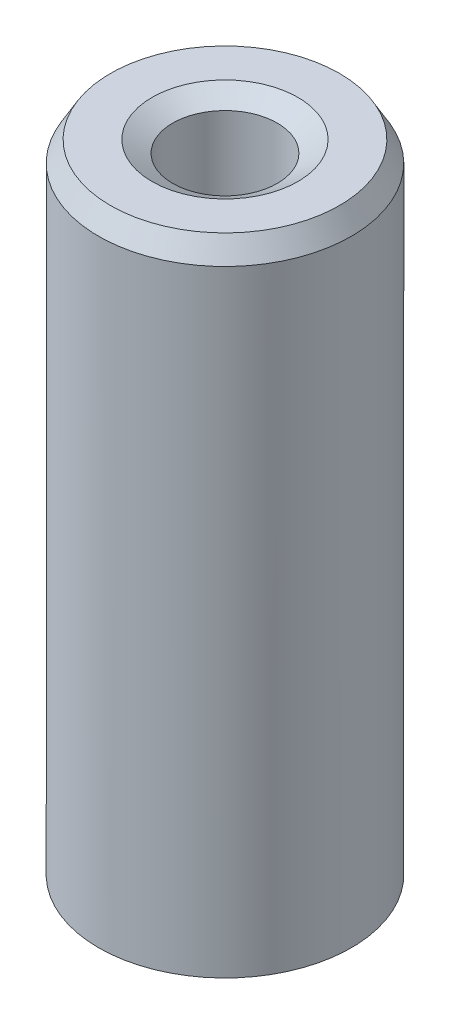
ISO-10303-21;
HEADER;
FILE_DESCRIPTION(('STEP AP214'),'2;1');
FILE_NAME('part.step','',(''),(''),'','','');
FILE_SCHEMA(('AUTOMOTIVE_DESIGN { 1 0 10303 214 1 1 1 1 }'));
ENDSEC;
DATA;
#1=APPLICATION_CONTEXT('core data for automotive mechanical design processes');
#2=APPLICATION_PROTOCOL_DEFINITION('international standard','automotive_design',2000,#1);
#3=PRODUCT_CONTEXT('',#1,'mechanical');
#4=PRODUCT('Part','Part','',(#3));
#5=PRODUCT_RELATED_PRODUCT_CATEGORY('part','',(#4));
#6=PRODUCT_DEFINITION_FORMATION('','',#4);
#7=PRODUCT_DEFINITION_CONTEXT('part definition',#1,'design');
#8=PRODUCT_DEFINITION('design','',#6,#7);
#9=PRODUCT_DEFINITION_SHAPE('','',#8);
#10=(LENGTH_UNIT() NAMED_UNIT(*) SI_UNIT(.MILLI.,.METRE.));
#11=(NAMED_UNIT(*) PLANE_ANGLE_UNIT() SI_UNIT($,.RADIAN.));
#12=(NAMED_UNIT(*) SI_UNIT($,.STERADIAN.) SOLID_ANGLE_UNIT());
#13=UNCERTAINTY_MEASURE_WITH_UNIT(LENGTH_MEASURE(1.E-05),#10,'distance_accuracy_value','');
#14=(GEOMETRIC_REPRESENTATION_CONTEXT(3) GLOBAL_UNCERTAINTY_ASSIGNED_CONTEXT((#13)) GLOBAL_UNIT_ASSIGNED_CONTEXT((#10,
#11,#12)) REPRESENTATION_CONTEXT('',''));
#15=CARTESIAN_POINT('',(0.,0.,0.));
#16=DIRECTION('',(0.,0.,1.));
#17=DIRECTION('',(1.,0.,0.));
#18=AXIS2_PLACEMENT_3D('',#15,#16,#17);
#19=CARTESIAN_POINT('',(0.,102.632128628166,0.));
#20=DIRECTION('',(0.,-1.,0.));
#21=DIRECTION('',(0.,0.,-1.));
#22=AXIS2_PLACEMENT_3D('',#19,#20,#21);
#23=CYLINDRICAL_SURFACE('',#22,20.);
#24=CARTESIAN_POINT('',(0.,1.88614223018305,0.));
#25=DIRECTION('',(0.,1.,0.));
#26=DIRECTION('',(0.,0.,1.));
#27=AXIS2_PLACEMENT_3D('',#24,#25,#26);
#28=CIRCLE('',#27,20.);
#29=CARTESIAN_POINT('',(0.,1.88614223018305,20.));
#30=VERTEX_POINT('',#29);
#31=EDGE_CURVE('E10',#30,#30,#28,.T.);
#32=ORIENTED_EDGE('',*,*,#31,.T.);
#33=EDGE_LOOP('',(#32));
#34=FACE_BOUND('',#33,.T.);
#35=CARTESIAN_POINT('',(0.,99.3652344551875,0.));
#36=DIRECTION('',(0.,1.,0.));
#37=DIRECTION('',(0.,0.,1.));
#38=AXIS2_PLACEMENT_3D('',#35,#36,#37);
#39=CIRCLE('',#38,20.);
#40=CARTESIAN_POINT('',(0.,99.3652344551875,-20.));
#41=VERTEX_POINT('',#40);
#42=EDGE_CURVE('E50',#41,#41,#39,.F.);
#43=ORIENTED_EDGE('',*,*,#42,.T.);
#44=EDGE_LOOP('',(#43));
#45=FACE_BOUND('',#44,.T.);
#46=ADVANCED_FACE('F39',(#34,#45),#23,.T.);
#47=CARTESIAN_POINT('',(0.,102.632128628166,0.));
#48=DIRECTION('',(0.,1.,0.));
#49=DIRECTION('',(0.,0.,1.));
#50=AXIS2_PLACEMENT_3D('',#47,#48,#49);
#51=PLANE('',#50);
#52=CARTESIAN_POINT('',(0.,102.632128628166,0.));
#53=DIRECTION('',(0.,1.,0.));
#54=DIRECTION('',(0.,0.,1.));
#55=AXIS2_PLACEMENT_3D('',#52,#53,#54);
#56=CIRCLE('',#55,11.539607365017);
#57=CARTESIAN_POINT('',(0.,102.632128628166,11.539607365017));
#58=VERTEX_POINT('',#57);
#59=EDGE_CURVE('E58',#58,#58,#56,.F.);
#60=ORIENTED_EDGE('',*,*,#59,.T.);
#61=EDGE_LOOP('',(#60));
#62=FACE_BOUND('',#61,.T.);
#63=CARTESIAN_POINT('',(0.,102.632128628166,0.));
#64=DIRECTION('',(0.,1.,0.));
#65=DIRECTION('',(0.,0.,1.));
#66=AXIS2_PLACEMENT_3D('',#63,#64,#65);
#67=CIRCLE('',#66,18.1138577698169);
#68=CARTESIAN_POINT('',(0.,102.632128628166,-18.1138577698169));
#69=VERTEX_POINT('',#68);
#70=EDGE_CURVE('E61',#69,#69,#67,.T.);
#71=ORIENTED_EDGE('',*,*,#70,.T.);
#72=EDGE_LOOP('',(#71));
#73=FACE_BOUND('',#72,.T.);
#74=ADVANCED_FACE('F88',(#62,#73),#51,.T.);
#75=CARTESIAN_POINT('',(0.,0.,0.));
#76=DIRECTION('',(0.,1.,0.));
#77=DIRECTION('',(0.,0.,1.));
#78=AXIS2_PLACEMENT_3D('',#75,#76,#77);
#79=PLANE('',#78);
#80=CARTESIAN_POINT('',(0.,0.,0.));
#81=DIRECTION('',(0.,1.,0.));
#82=DIRECTION('',(0.,0.,1.));
#83=AXIS2_PLACEMENT_3D('',#80,#81,#82);
#84=CIRCLE('',#83,10.1588554222217);
#85=CARTESIAN_POINT('',(0.,0.,10.1588554222217));
#86=VERTEX_POINT('',#85);
#87=EDGE_CURVE('E51',#86,#86,#84,.T.);
#88=ORIENTED_EDGE('',*,*,#87,.T.);
#89=EDGE_LOOP('',(#88));
#90=FACE_BOUND('',#89,.T.);
#91=CARTESIAN_POINT('',(0.,0.,0.));
#92=DIRECTION('',(0.,1.,0.));
#93=DIRECTION('',(0.,0.,1.));
#94=AXIS2_PLACEMENT_3D('',#91,#92,#93);
#95=CIRCLE('',#94,16.7331058270217);
#96=CARTESIAN_POINT('',(0.,0.,16.7331058270217));
#97=VERTEX_POINT('',#96);
#98=EDGE_CURVE('E54',#97,#97,#95,.F.);
#99=ORIENTED_EDGE('',*,*,#98,.T.);
#100=EDGE_LOOP('',(#99));
#101=FACE_BOUND('',#100,.T.);
#102=ADVANCED_FACE('F83',(#90,#101),#79,.F.);
#103=CARTESIAN_POINT('',(0.,102.632128628166,0.));
#104=DIRECTION('',(0.,-1.,0.));
#105=DIRECTION('',(0.,0.,-1.));
#106=AXIS2_PLACEMENT_3D('',#103,#104,#105);
#107=CYLINDRICAL_SURFACE('',#106,8.27271319203861);
#108=CARTESIAN_POINT('',(0.,100.745986397983,0.));
#109=DIRECTION('',(0.,1.,0.));
#110=DIRECTION('',(0.,0.,1.));
#111=AXIS2_PLACEMENT_3D('',#108,#109,#110);
#112=CIRCLE('',#111,8.27271319203861);
#113=CARTESIAN_POINT('',(0.,100.745986397983,8.27271319203861));
#114=VERTEX_POINT('',#113);
#115=EDGE_CURVE('E67',#114,#114,#112,.T.);
#116=ORIENTED_EDGE('',*,*,#115,.T.);
#117=EDGE_LOOP('',(#116));
#118=FACE_BOUND('',#117,.T.);
#119=CARTESIAN_POINT('',(0.,3.26689417297835,0.));
#120=DIRECTION('',(0.,1.,0.));
#121=DIRECTION('',(0.,0.,1.));
#122=AXIS2_PLACEMENT_3D('',#119,#120,#121);
#123=CIRCLE('',#122,8.27271319203861);
#124=CARTESIAN_POINT('',(0.,3.26689417297835,8.27271319203861));
#125=VERTEX_POINT('',#124);
#126=EDGE_CURVE('E69',#125,#125,#123,.F.);
#127=ORIENTED_EDGE('',*,*,#126,.T.);
#128=EDGE_LOOP('',(#127));
#129=FACE_BOUND('',#128,.T.);
#130=ADVANCED_FACE('F71',(#118,#129),#107,.F.);
#131=CARTESIAN_POINT('',(0.,100.745986397983,0.));
#132=DIRECTION('',(0.,1.,0.));
#133=DIRECTION('',(0.,0.,1.));
#134=AXIS2_PLACEMENT_3D('',#131,#132,#133);
#135=CONICAL_SURFACE('',#134,8.27271319203861,1.0471975511966);
#136=ORIENTED_EDGE('',*,*,#59,.F.);
#137=EDGE_LOOP('',(#136));
#138=FACE_BOUND('',#137,.T.);
#139=ORIENTED_EDGE('',*,*,#115,.F.);
#140=EDGE_LOOP('',(#139));
#141=FACE_BOUND('',#140,.T.);
#142=ADVANCED_FACE('F77',(#138,#141),#135,.F.);
#143=CARTESIAN_POINT('',(0.,0.,0.));
#144=DIRECTION('',(0.,-1.,0.));
#145=DIRECTION('',(0.,0.,-1.));
#146=AXIS2_PLACEMENT_3D('',#143,#144,#145);
#147=CONICAL_SURFACE('',#146,10.1588554222217,0.523598775598296);
#148=ORIENTED_EDGE('',*,*,#126,.F.);
#149=EDGE_LOOP('',(#148));
#150=FACE_BOUND('',#149,.T.);
#151=ORIENTED_EDGE('',*,*,#87,.F.);
#152=EDGE_LOOP('',(#151));
#153=FACE_BOUND('',#152,.T.);
#154=ADVANCED_FACE('F73',(#150,#153),#147,.F.);
#155=CARTESIAN_POINT('',(0.,1.88614223018305,0.));
#156=DIRECTION('',(0.,1.,0.));
#157=DIRECTION('',(0.,0.,1.));
#158=AXIS2_PLACEMENT_3D('',#155,#156,#157);
#159=CONICAL_SURFACE('',#158,20.,1.0471975511966);
#160=ORIENTED_EDGE('',*,*,#98,.F.);
#161=EDGE_LOOP('',(#160));
#162=FACE_BOUND('',#161,.T.);
#163=ORIENTED_EDGE('',*,*,#31,.F.);
#164=EDGE_LOOP('',(#163));
#165=FACE_BOUND('',#164,.T.);
#166=ADVANCED_FACE('F76',(#162,#165),#159,.T.);
#167=CARTESIAN_POINT('',(0.,102.632128628166,0.));
#168=DIRECTION('',(0.,-1.,0.));
#169=DIRECTION('',(0.,0.,-1.));
#170=AXIS2_PLACEMENT_3D('',#167,#168,#169);
#171=CONICAL_SURFACE('',#170,18.1138577698169,0.523598775598296);
#172=CARTESIAN_POINT('',(0.,99.3652344551875,-20.));
#173=CARTESIAN_POINT('',(0.,99.3992646028227,-19.9803526851023));
#174=CARTESIAN_POINT('',(0.,99.4332947504579,-19.9607053702045));
#175=CARTESIAN_POINT('',(0.,99.5013550457282,-19.921410740409));
#176=CARTESIAN_POINT('',(0.,99.5353851933634,-19.9017634255113));
#177=CARTESIAN_POINT('',(0.,99.6034454886338,-19.8624687957158));
#178=CARTESIAN_POINT('',(0.,99.637475636269,-19.8428214808181));
#179=CARTESIAN_POINT('',(0.,99.7055359315394,-19.8035268510226));
#180=CARTESIAN_POINT('',(0.,99.7395660791746,-19.7838795361249));
#181=CARTESIAN_POINT('',(0.,99.807626374445,-19.7445849063294));
#182=CARTESIAN_POINT('',(0.,99.8416565220802,-19.7249375914316));
#183=CARTESIAN_POINT('',(0.,99.9097168173505,-19.6856429616362));
#184=CARTESIAN_POINT('',(0.,99.9437469649857,-19.6659956467384));
#185=CARTESIAN_POINT('',(0.,100.011807260256,-19.6267010169429));
#186=CARTESIAN_POINT('',(0.,100.045837407891,-19.6070537020452));
#187=CARTESIAN_POINT('',(0.,100.113897703162,-19.5677590722497));
#188=CARTESIAN_POINT('',(0.,100.147927850797,-19.548111757352));
#189=CARTESIAN_POINT('',(0.,100.215988146067,-19.5088171275565));
#190=CARTESIAN_POINT('',(0.,100.250018293702,-19.4891698126588));
#191=CARTESIAN_POINT('',(0.,100.318078588973,-19.4498751828633));
#192=CARTESIAN_POINT('',(0.,100.352108736608,-19.4302278679655));
#193=CARTESIAN_POINT('',(0.,100.420169031878,-19.3909332381701));
#194=CARTESIAN_POINT('',(0.,100.454199179514,-19.3712859232723));
#195=CARTESIAN_POINT('',(0.,100.522259474784,-19.3319912934768));
#196=CARTESIAN_POINT('',(0.,100.556289622419,-19.3123439785791));
#197=CARTESIAN_POINT('',(0.,100.62434991769,-19.2730493487836));
#198=CARTESIAN_POINT('',(0.,100.658380065325,-19.2534020338859));
#199=CARTESIAN_POINT('',(0.,100.726440360595,-19.2141074040904));
#200=CARTESIAN_POINT('',(0.,100.76047050823,-19.1944600891927));
#201=CARTESIAN_POINT('',(0.,100.828530803501,-19.1551654593972));
#202=CARTESIAN_POINT('',(0.,100.862560951136,-19.1355181444994));
#203=CARTESIAN_POINT('',(0.,100.930621246406,-19.096223514704));
#204=CARTESIAN_POINT('',(0.,100.964651394041,-19.0765761998062));
#205=CARTESIAN_POINT('',(0.,101.032711689312,-19.0372815700107));
#206=CARTESIAN_POINT('',(0.,101.066741836947,-19.017634255113));
#207=CARTESIAN_POINT('',(0.,101.134802132217,-18.9783396253175));
#208=CARTESIAN_POINT('',(0.,101.168832279853,-18.9586923104198));
#209=CARTESIAN_POINT('',(0.,101.236892575123,-18.9193976806243));
#210=CARTESIAN_POINT('',(0.,101.270922722758,-18.8997503657266));
#211=CARTESIAN_POINT('',(0.,101.338983018029,-18.8604557359311));
#212=CARTESIAN_POINT('',(0.,101.373013165664,-18.8408084210333));
#213=CARTESIAN_POINT('',(0.,101.441073460934,-18.8015137912378));
#214=CARTESIAN_POINT('',(0.,101.475103608569,-18.7818664763401));
#215=CARTESIAN_POINT('',(0.,101.54316390384,-18.7425718465446));
#216=CARTESIAN_POINT('',(0.,101.577194051475,-18.7229245316469));
#217=CARTESIAN_POINT('',(0.,101.645254346745,-18.6836299018514));
#218=CARTESIAN_POINT('',(0.,101.67928449438,-18.6639825869537));
#219=CARTESIAN_POINT('',(0.,101.747344789651,-18.6246879571582));
#220=CARTESIAN_POINT('',(0.,101.781374937286,-18.6050406422604));
#221=CARTESIAN_POINT('',(0.,101.849435232556,-18.565746012465));
#222=CARTESIAN_POINT('',(0.,101.883465380192,-18.5460986975672));
#223=CARTESIAN_POINT('',(0.,101.951525675462,-18.5068040677717));
#224=CARTESIAN_POINT('',(0.,101.985555823097,-18.487156752874));
#225=CARTESIAN_POINT('',(0.,102.053616118368,-18.4478621230785));
#226=CARTESIAN_POINT('',(0.,102.087646266003,-18.4282148081808));
#227=CARTESIAN_POINT('',(0.,102.155706561273,-18.3889201783853));
#228=CARTESIAN_POINT('',(0.,102.189736708908,-18.3692728634876));
#229=CARTESIAN_POINT('',(0.,102.257797004179,-18.3299782336921));
#230=CARTESIAN_POINT('',(0.,102.291827151814,-18.3103309187943));
#231=CARTESIAN_POINT('',(0.,102.359887447084,-18.2710362889989));
#232=CARTESIAN_POINT('',(0.,102.393917594719,-18.2513889741011));
#233=CARTESIAN_POINT('',(0.,102.46197788999,-18.2120943443056));
#234=CARTESIAN_POINT('',(0.,102.496008037625,-18.1924470294079));
#235=CARTESIAN_POINT('',(0.,102.564068332895,-18.1531523996124));
#236=CARTESIAN_POINT('',(0.,102.598098480531,-18.1335050847147));
#237=CARTESIAN_POINT('',(0.,102.632128628166,-18.1138577698169));
#238=B_SPLINE_CURVE_WITH_KNOTS('',3,(#172,#173,#174,#175,#176,#177,#178,#179,#180,#181,#182,
#183,#184,#185,#186,#187,#188,#189,#190,#191,#192,#193,#194,#195,#196,#197,#198,#199,#200,#201,
#202,#203,#204,#205,#206,#207,#208,#209,#210,#211,#212,#213,#214,#215,#216,#217,#218,#219,#220,
#221,#222,#223,#224,#225,#226,#227,#228,#229,#230,#231,#232,#233,#234,#235,#236,#237),
.UNSPECIFIED.,.F.,.F.,(4,2,2,2,2,2,2,2,2,2,2,2,2,2,2,2,2,2,2,2,2,2,2,2,2,2,2,2,2,2,2,2,4),(0.,
0.11788388938644,0.235767778772882,0.353651668159322,0.471535557545763,0.589419446932205,
0.707303336318645,0.825187225705087,0.943071115091527,1.06095500447797,1.17883889386441,
1.29672278325086,1.4146066726373,1.53249056202374,1.65037445141019,1.76825834079663,
1.88614223018307,2.00402611956951,2.12191000895595,2.23979389834239,2.35767778772883,
2.47556167711527,2.59344556650173,2.71132945588817,2.82921334527461,2.94709723466105,
3.06498112404749,3.18286501343393,3.30074890282037,3.41863279220681,3.53651668159325,
3.65440057097969,3.77228446036615),.UNSPECIFIED.);
#239=EDGE_CURVE('BSEAM45',#41,#69,#238,.T.);
#240=ORIENTED_EDGE('',*,*,#42,.F.);
#241=ORIENTED_EDGE('',*,*,#70,.F.);
#242=ORIENTED_EDGE('',*,*,#239,.T.);
#243=ORIENTED_EDGE('',*,*,#239,.F.);
#244=EDGE_LOOP('',(#240,#242,#241,#243));
#245=FACE_BOUND('',#244,.T.);
#246=ADVANCED_FACE('F45',(#245),#171,.T.);
#247=CLOSED_SHELL('',(#46,#74,#102,#130,#142,#154,#166,#246));
#248=MANIFOLD_SOLID_BREP('B2',#247);
#249=ADVANCED_BREP_SHAPE_REPRESENTATION('',(#18,#248),#14);
#250=SHAPE_DEFINITION_REPRESENTATION(#9,#249);
ENDSEC;
END-ISO-10303-21;
